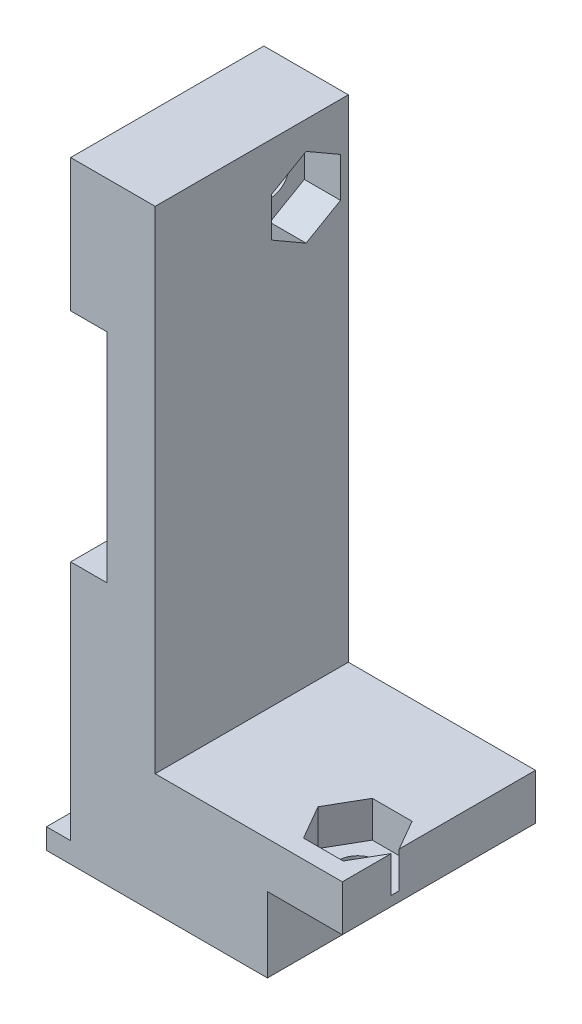
ISO-10303-21;
HEADER;
FILE_DESCRIPTION(('STEP AP214'),'2;1');
FILE_NAME('part.step','',(''),(''),'','','');
FILE_SCHEMA(('AUTOMOTIVE_DESIGN { 1 0 10303 214 1 1 1 1 }'));
ENDSEC;
DATA;
#1=APPLICATION_CONTEXT('core data for automotive mechanical design processes');
#2=APPLICATION_PROTOCOL_DEFINITION('international standard','automotive_design',2000,#1);
#3=PRODUCT_CONTEXT('',#1,'mechanical');
#4=PRODUCT('Part','Part','',(#3));
#5=PRODUCT_RELATED_PRODUCT_CATEGORY('part','',(#4));
#6=PRODUCT_DEFINITION_FORMATION('','',#4);
#7=PRODUCT_DEFINITION_CONTEXT('part definition',#1,'design');
#8=PRODUCT_DEFINITION('design','',#6,#7);
#9=PRODUCT_DEFINITION_SHAPE('','',#8);
#10=(LENGTH_UNIT() NAMED_UNIT(*) SI_UNIT(.MILLI.,.METRE.));
#11=(NAMED_UNIT(*) PLANE_ANGLE_UNIT() SI_UNIT($,.RADIAN.));
#12=(NAMED_UNIT(*) SI_UNIT($,.STERADIAN.) SOLID_ANGLE_UNIT());
#13=UNCERTAINTY_MEASURE_WITH_UNIT(LENGTH_MEASURE(1.E-05),#10,'distance_accuracy_value','');
#14=(GEOMETRIC_REPRESENTATION_CONTEXT(3) GLOBAL_UNCERTAINTY_ASSIGNED_CONTEXT((#13)) GLOBAL_UNIT_ASSIGNED_CONTEXT((#10,
#11,#12)) REPRESENTATION_CONTEXT('',''));
#15=CARTESIAN_POINT('',(0.,0.,0.));
#16=DIRECTION('',(0.,0.,1.));
#17=DIRECTION('',(1.,0.,0.));
#18=AXIS2_PLACEMENT_3D('',#15,#16,#17);
#19=CARTESIAN_POINT('',(21.4,50.701,11.62));
#20=DIRECTION('',(0.,-1.,0.));
#21=DIRECTION('',(1.,0.,0.));
#22=AXIS2_PLACEMENT_3D('',#19,#20,#21);
#23=CYLINDRICAL_SURFACE('',#22,1.6);
#24=CARTESIAN_POINT('',(21.4,6.2,11.62));
#25=DIRECTION('',(0.,-1.,0.));
#26=DIRECTION('',(1.,0.,0.));
#27=AXIS2_PLACEMENT_3D('',#24,#25,#26);
#28=CIRCLE('',#27,1.6);
#29=CARTESIAN_POINT('',(23.,6.2,11.62));
#30=VERTEX_POINT('',#29);
#31=EDGE_CURVE('E271',#30,#30,#28,.T.);
#32=ORIENTED_EDGE('',*,*,#31,.T.);
#33=EDGE_LOOP('',(#32));
#34=FACE_BOUND('',#33,.T.);
#35=CARTESIAN_POINT('',(21.4,7.,11.62));
#36=DIRECTION('',(0.,1.,0.));
#37=DIRECTION('',(0.,0.,1.));
#38=AXIS2_PLACEMENT_3D('',#35,#36,#37);
#39=CIRCLE('',#38,1.6);
#40=CARTESIAN_POINT('',(21.4,7.,13.22));
#41=VERTEX_POINT('',#40);
#42=EDGE_CURVE('E36',#41,#41,#39,.F.);
#43=ORIENTED_EDGE('',*,*,#42,.F.);
#44=EDGE_LOOP('',(#43));
#45=FACE_BOUND('',#44,.T.);
#46=ADVANCED_FACE('F32',(#34,#45),#23,.F.);
#47=CARTESIAN_POINT('',(24.501,45.1,3.5));
#48=DIRECTION('',(-1.,0.,0.));
#49=DIRECTION('',(0.,0.,1.));
#50=AXIS2_PLACEMENT_3D('',#47,#48,#49);
#51=CYLINDRICAL_SURFACE('',#50,1.6);
#52=CARTESIAN_POINT('',(2.,45.1,3.5));
#53=DIRECTION('',(-1.,0.,0.));
#54=DIRECTION('',(0.,0.,1.));
#55=AXIS2_PLACEMENT_3D('',#52,#53,#54);
#56=CIRCLE('',#55,1.6);
#57=CARTESIAN_POINT('',(2.,45.1,5.1));
#58=VERTEX_POINT('',#57);
#59=EDGE_CURVE('E321',#58,#58,#56,.T.);
#60=ORIENTED_EDGE('',*,*,#59,.T.);
#61=EDGE_LOOP('',(#60));
#62=FACE_BOUND('',#61,.T.);
#63=CARTESIAN_POINT('',(6.,45.1,3.5));
#64=DIRECTION('',(1.,0.,0.));
#65=DIRECTION('',(0.,0.,-1.));
#66=AXIS2_PLACEMENT_3D('',#63,#64,#65);
#67=CIRCLE('',#66,1.6);
#68=CARTESIAN_POINT('',(6.,45.1,1.9));
#69=VERTEX_POINT('',#68);
#70=EDGE_CURVE('E311',#69,#69,#67,.F.);
#71=ORIENTED_EDGE('',*,*,#70,.F.);
#72=EDGE_LOOP('',(#71));
#73=FACE_BOUND('',#72,.T.);
#74=ADVANCED_FACE('F427',(#62,#73),#51,.F.);
#75=CARTESIAN_POINT('',(24.5,0.,16.));
#76=DIRECTION('',(0.,1.,0.));
#77=DIRECTION('',(0.,0.,1.));
#78=AXIS2_PLACEMENT_3D('',#75,#76,#77);
#79=PLANE('',#78);
#80=DIRECTION('',(1.,0.,0.));
#81=VECTOR('',#80,1.);
#82=CARTESIAN_POINT('',(24.5,0.,0.));
#83=LINE('',#82,#81);
#84=CARTESIAN_POINT('',(0.,0.,0.));
#85=VERTEX_POINT('',#84);
#86=CARTESIAN_POINT('',(18.3,0.,0.));
#87=VERTEX_POINT('',#86);
#88=EDGE_CURVE('E342',#85,#87,#83,.T.);
#89=ORIENTED_EDGE('',*,*,#88,.T.);
#90=DIRECTION('',(0.,0.,1.));
#91=VECTOR('',#90,1.);
#92=CARTESIAN_POINT('',(18.3,0.,-0.001000000000001));
#93=LINE('',#92,#91);
#94=CARTESIAN_POINT('',(18.3,0.,16.));
#95=VERTEX_POINT('',#94);
#96=EDGE_CURVE('E333',#87,#95,#93,.T.);
#97=ORIENTED_EDGE('',*,*,#96,.T.);
#98=DIRECTION('',(1.,0.,0.));
#99=VECTOR('',#98,1.);
#100=CARTESIAN_POINT('',(24.5,0.,16.));
#101=LINE('',#100,#99);
#102=CARTESIAN_POINT('',(0.,0.,16.));
#103=VERTEX_POINT('',#102);
#104=EDGE_CURVE('E343',#103,#95,#101,.T.);
#105=ORIENTED_EDGE('',*,*,#104,.F.);
#106=DIRECTION('',(0.,0.,-1.));
#107=VECTOR('',#106,1.);
#108=CARTESIAN_POINT('',(0.,0.,16.));
#109=LINE('',#108,#107);
#110=EDGE_CURVE('E369',#103,#85,#109,.T.);
#111=ORIENTED_EDGE('',*,*,#110,.T.);
#112=EDGE_LOOP('',(#89,#97,#105,#111));
#113=FACE_BOUND('',#112,.T.);
#114=ADVANCED_FACE('F34',(#113),#79,.F.);
#115=CARTESIAN_POINT('',(24.5,10.,16.));
#116=DIRECTION('',(-1.,0.,0.));
#117=DIRECTION('',(0.,0.,1.));
#118=AXIS2_PLACEMENT_3D('',#115,#116,#117);
#119=PLANE('',#118);
#120=DIRECTION('',(0.,0.,-1.));
#121=VECTOR('',#120,1.);
#122=CARTESIAN_POINT('',(24.5,10.,16.));
#123=LINE('',#122,#121);
#124=CARTESIAN_POINT('',(24.5,10.,11.2893575034635));
#125=VERTEX_POINT('',#124);
#126=CARTESIAN_POINT('',(24.5,10.,0.));
#127=VERTEX_POINT('',#126);
#128=EDGE_CURVE('E41',#125,#127,#123,.T.);
#129=ORIENTED_EDGE('',*,*,#128,.F.);
#130=DIRECTION('',(0.,-1.,0.));
#131=VECTOR('',#130,1.);
#132=CARTESIAN_POINT('',(24.5,10.,11.2893575034635));
#133=LINE('',#132,#131);
#134=CARTESIAN_POINT('',(24.5,7.,11.2893575034635));
#135=VERTEX_POINT('',#134);
#136=EDGE_CURVE('E268',#125,#135,#133,.T.);
#137=ORIENTED_EDGE('',*,*,#136,.T.);
#138=DIRECTION('',(0.,0.,-1.));
#139=VECTOR('',#138,1.);
#140=CARTESIAN_POINT('',(24.5,7.,16.));
#141=LINE('',#140,#139);
#142=CARTESIAN_POINT('',(24.5,7.,11.9506424965365));
#143=VERTEX_POINT('',#142);
#144=EDGE_CURVE('E263',#143,#135,#141,.T.);
#145=ORIENTED_EDGE('',*,*,#144,.F.);
#146=DIRECTION('',(0.,1.,0.));
#147=VECTOR('',#146,1.);
#148=CARTESIAN_POINT('',(24.5,10.,11.9506424965365));
#149=LINE('',#148,#147);
#150=CARTESIAN_POINT('',(24.5,10.,11.9506424965365));
#151=VERTEX_POINT('',#150);
#152=EDGE_CURVE('E265',#143,#151,#149,.T.);
#153=ORIENTED_EDGE('',*,*,#152,.T.);
#154=CARTESIAN_POINT('',(24.5,10.,16.));
#155=VERTEX_POINT('',#154);
#156=EDGE_CURVE('E11',#155,#151,#123,.T.);
#157=ORIENTED_EDGE('',*,*,#156,.F.);
#158=DIRECTION('',(0.,1.,0.));
#159=VECTOR('',#158,1.);
#160=CARTESIAN_POINT('',(24.5,10.,16.));
#161=LINE('',#160,#159);
#162=CARTESIAN_POINT('',(24.5,6.2,16.));
#163=VERTEX_POINT('',#162);
#164=EDGE_CURVE('E346',#163,#155,#161,.T.);
#165=ORIENTED_EDGE('',*,*,#164,.F.);
#166=DIRECTION('',(0.,0.,1.));
#167=VECTOR('',#166,1.);
#168=CARTESIAN_POINT('',(24.5,6.2,-0.001000000000001));
#169=LINE('',#168,#167);
#170=CARTESIAN_POINT('',(24.5,6.2,0.));
#171=VERTEX_POINT('',#170);
#172=EDGE_CURVE('E332',#171,#163,#169,.T.);
#173=ORIENTED_EDGE('',*,*,#172,.F.);
#174=DIRECTION('',(0.,1.,0.));
#175=VECTOR('',#174,1.);
#176=CARTESIAN_POINT('',(24.5,10.,0.));
#177=LINE('',#176,#175);
#178=EDGE_CURVE('E372',#171,#127,#177,.T.);
#179=ORIENTED_EDGE('',*,*,#178,.T.);
#180=EDGE_LOOP('',(#129,#137,#145,#153,#157,#165,#173,#179));
#181=FACE_BOUND('',#180,.T.);
#182=ADVANCED_FACE('F435',(#181),#119,.F.);
#183=CARTESIAN_POINT('',(9.00000000000001,10.,16.));
#184=DIRECTION('',(0.,-1.,0.));
#185=DIRECTION('',(0.,0.,-1.));
#186=AXIS2_PLACEMENT_3D('',#183,#184,#185);
#187=PLANE('',#186);
#188=DIRECTION('',(-1.,0.,0.));
#189=VECTOR('',#188,1.);
#190=CARTESIAN_POINT('',(23.0454482671904,10.,8.77));
#191=LINE('',#190,#189);
#192=CARTESIAN_POINT('',(23.0454482671904,10.,8.77));
#193=VERTEX_POINT('',#192);
#194=CARTESIAN_POINT('',(19.7545517328096,10.,8.77));
#195=VERTEX_POINT('',#194);
#196=EDGE_CURVE('E237',#193,#195,#191,.T.);
#197=ORIENTED_EDGE('',*,*,#196,.F.);
#198=DIRECTION('',(-0.499999999999999,0.,-0.866025403784439));
#199=VECTOR('',#198,1.);
#200=CARTESIAN_POINT('',(24.6908965343809,10.,11.62));
#201=LINE('',#200,#199);
#202=EDGE_CURVE('E251',#125,#193,#201,.T.);
#203=ORIENTED_EDGE('',*,*,#202,.F.);
#204=ORIENTED_EDGE('',*,*,#128,.T.);
#205=DIRECTION('',(-1.,0.,0.));
#206=VECTOR('',#205,1.);
#207=CARTESIAN_POINT('',(9.00000000000001,10.,0.));
#208=LINE('',#207,#206);
#209=CARTESIAN_POINT('',(9.00000000000001,10.,0.));
#210=VERTEX_POINT('',#209);
#211=EDGE_CURVE('E375',#127,#210,#208,.T.);
#212=ORIENTED_EDGE('',*,*,#211,.T.);
#213=DIRECTION('',(0.,0.,-1.));
#214=VECTOR('',#213,1.);
#215=CARTESIAN_POINT('',(9.00000000000001,10.,16.));
#216=LINE('',#215,#214);
#217=CARTESIAN_POINT('',(9.00000000000001,10.,16.));
#218=VERTEX_POINT('',#217);
#219=EDGE_CURVE('E420',#218,#210,#216,.T.);
#220=ORIENTED_EDGE('',*,*,#219,.F.);
#221=DIRECTION('',(-1.,0.,0.));
#222=VECTOR('',#221,1.);
#223=CARTESIAN_POINT('',(9.00000000000001,10.,16.));
#224=LINE('',#223,#222);
#225=EDGE_CURVE('E349',#155,#218,#224,.T.);
#226=ORIENTED_EDGE('',*,*,#225,.F.);
#227=ORIENTED_EDGE('',*,*,#156,.T.);
#228=DIRECTION('',(0.5,0.,-0.866025403784439));
#229=VECTOR('',#228,1.);
#230=CARTESIAN_POINT('',(23.0454482671904,10.,14.47));
#231=LINE('',#230,#229);
#232=CARTESIAN_POINT('',(23.0454482671904,10.,14.47));
#233=VERTEX_POINT('',#232);
#234=EDGE_CURVE('E249',#233,#151,#231,.T.);
#235=ORIENTED_EDGE('',*,*,#234,.F.);
#236=DIRECTION('',(1.,0.,0.));
#237=VECTOR('',#236,1.);
#238=CARTESIAN_POINT('',(19.7545517328096,10.,14.47));
#239=LINE('',#238,#237);
#240=CARTESIAN_POINT('',(19.7545517328096,10.,14.47));
#241=VERTEX_POINT('',#240);
#242=EDGE_CURVE('E247',#241,#233,#239,.T.);
#243=ORIENTED_EDGE('',*,*,#242,.F.);
#244=DIRECTION('',(0.499999999999999,0.,0.866025403784439));
#245=VECTOR('',#244,1.);
#246=CARTESIAN_POINT('',(18.1091034656191,10.,11.62));
#247=LINE('',#246,#245);
#248=CARTESIAN_POINT('',(18.1091034656191,10.,11.62));
#249=VERTEX_POINT('',#248);
#250=EDGE_CURVE('E49',#249,#241,#247,.T.);
#251=ORIENTED_EDGE('',*,*,#250,.F.);
#252=DIRECTION('',(-0.500000000000001,0.,0.866025403784438));
#253=VECTOR('',#252,1.);
#254=CARTESIAN_POINT('',(19.7545517328096,10.,8.77));
#255=LINE('',#254,#253);
#256=EDGE_CURVE('E234',#195,#249,#255,.T.);
#257=ORIENTED_EDGE('',*,*,#256,.F.);
#258=EDGE_LOOP('',(#197,#203,#204,#212,#220,#226,#227,#235,#243,#251,#257));
#259=FACE_BOUND('',#258,.T.);
#260=ADVANCED_FACE('F494',(#259),#187,.F.);
#261=CARTESIAN_POINT('',(9.,50.7,16.));
#262=DIRECTION('',(-1.,0.,0.));
#263=DIRECTION('',(0.,-1.,0.));
#264=AXIS2_PLACEMENT_3D('',#261,#262,#263);
#265=PLANE('',#264);
#266=DIRECTION('',(0.,0.499999999999999,0.866025403784439));
#267=VECTOR('',#266,1.);
#268=CARTESIAN_POINT('',(9.,46.7454482671904,0.650000000000012));
#269=LINE('',#268,#267);
#270=CARTESIAN_POINT('',(9.,46.7454482671904,0.650000000000012));
#271=VERTEX_POINT('',#270);
#272=CARTESIAN_POINT('',(9.,48.3908965343809,3.5));
#273=VERTEX_POINT('',#272);
#274=EDGE_CURVE('E295',#271,#273,#269,.T.);
#275=ORIENTED_EDGE('',*,*,#274,.F.);
#276=DIRECTION('',(0.,1.,0.));
#277=VECTOR('',#276,1.);
#278=CARTESIAN_POINT('',(9.,43.4545517328096,0.650000000000012));
#279=LINE('',#278,#277);
#280=CARTESIAN_POINT('',(9.,43.4545517328096,0.650000000000012));
#281=VERTEX_POINT('',#280);
#282=EDGE_CURVE('E57',#281,#271,#279,.T.);
#283=ORIENTED_EDGE('',*,*,#282,.F.);
#284=DIRECTION('',(0.,0.499999999999999,-0.866025403784439));
#285=VECTOR('',#284,1.);
#286=CARTESIAN_POINT('',(9.,41.8091034656191,3.5));
#287=LINE('',#286,#285);
#288=CARTESIAN_POINT('',(9.,41.8091034656191,3.5));
#289=VERTEX_POINT('',#288);
#290=EDGE_CURVE('E278',#289,#281,#287,.T.);
#291=ORIENTED_EDGE('',*,*,#290,.F.);
#292=DIRECTION('',(0.,-0.5,-0.866025403784439));
#293=VECTOR('',#292,1.);
#294=CARTESIAN_POINT('',(9.,43.4545517328096,6.35));
#295=LINE('',#294,#293);
#296=CARTESIAN_POINT('',(9.,43.4545517328096,6.35));
#297=VERTEX_POINT('',#296);
#298=EDGE_CURVE('E304',#297,#289,#295,.T.);
#299=ORIENTED_EDGE('',*,*,#298,.F.);
#300=DIRECTION('',(0.,-1.,0.));
#301=VECTOR('',#300,1.);
#302=CARTESIAN_POINT('',(9.,46.7454482671904,6.35));
#303=LINE('',#302,#301);
#304=CARTESIAN_POINT('',(9.,46.7454482671904,6.35));
#305=VERTEX_POINT('',#304);
#306=EDGE_CURVE('E301',#305,#297,#303,.T.);
#307=ORIENTED_EDGE('',*,*,#306,.F.);
#308=DIRECTION('',(0.,-0.499999999999999,0.866025403784439));
#309=VECTOR('',#308,1.);
#310=CARTESIAN_POINT('',(9.,48.3908965343809,3.5));
#311=LINE('',#310,#309);
#312=EDGE_CURVE('E298',#273,#305,#311,.T.);
#313=ORIENTED_EDGE('',*,*,#312,.F.);
#314=EDGE_LOOP('',(#275,#283,#291,#299,#307,#313));
#315=FACE_BOUND('',#314,.T.);
#316=DIRECTION('',(0.,1.,0.));
#317=VECTOR('',#316,1.);
#318=CARTESIAN_POINT('',(9.,50.7,0.));
#319=LINE('',#318,#317);
#320=CARTESIAN_POINT('',(9.,50.7,0.));
#321=VERTEX_POINT('',#320);
#322=EDGE_CURVE('E377',#210,#321,#319,.T.);
#323=ORIENTED_EDGE('',*,*,#322,.T.);
#324=DIRECTION('',(0.,0.,-1.));
#325=VECTOR('',#324,1.);
#326=CARTESIAN_POINT('',(9.,50.7,16.));
#327=LINE('',#326,#325);
#328=CARTESIAN_POINT('',(9.,50.7,16.));
#329=VERTEX_POINT('',#328);
#330=EDGE_CURVE('E417',#329,#321,#327,.T.);
#331=ORIENTED_EDGE('',*,*,#330,.F.);
#332=DIRECTION('',(0.,1.,0.));
#333=VECTOR('',#332,1.);
#334=CARTESIAN_POINT('',(9.,50.7,16.));
#335=LINE('',#334,#333);
#336=EDGE_CURVE('E351',#218,#329,#335,.T.);
#337=ORIENTED_EDGE('',*,*,#336,.F.);
#338=ORIENTED_EDGE('',*,*,#219,.T.);
#339=EDGE_LOOP('',(#323,#331,#337,#338));
#340=FACE_BOUND('',#339,.T.);
#341=ADVANCED_FACE('F490',(#315,#340),#265,.F.);
#342=CARTESIAN_POINT('',(2.,50.7,16.));
#343=DIRECTION('',(0.,-1.,0.));
#344=DIRECTION('',(1.,0.,0.));
#345=AXIS2_PLACEMENT_3D('',#342,#343,#344);
#346=PLANE('',#345);
#347=DIRECTION('',(-1.,0.,0.));
#348=VECTOR('',#347,1.);
#349=CARTESIAN_POINT('',(2.,50.7,0.));
#350=LINE('',#349,#348);
#351=CARTESIAN_POINT('',(2.,50.7,0.));
#352=VERTEX_POINT('',#351);
#353=EDGE_CURVE('E379',#321,#352,#350,.T.);
#354=ORIENTED_EDGE('',*,*,#353,.T.);
#355=DIRECTION('',(0.,0.,-1.));
#356=VECTOR('',#355,1.);
#357=CARTESIAN_POINT('',(2.,50.7,16.));
#358=LINE('',#357,#356);
#359=CARTESIAN_POINT('',(2.,50.7,16.));
#360=VERTEX_POINT('',#359);
#361=EDGE_CURVE('E414',#360,#352,#358,.T.);
#362=ORIENTED_EDGE('',*,*,#361,.F.);
#363=DIRECTION('',(-1.,0.,0.));
#364=VECTOR('',#363,1.);
#365=CARTESIAN_POINT('',(2.,50.7,16.));
#366=LINE('',#365,#364);
#367=EDGE_CURVE('E353',#329,#360,#366,.T.);
#368=ORIENTED_EDGE('',*,*,#367,.F.);
#369=ORIENTED_EDGE('',*,*,#330,.T.);
#370=EDGE_LOOP('',(#354,#362,#368,#369));
#371=FACE_BOUND('',#370,.T.);
#372=ADVANCED_FACE('F486',(#371),#346,.F.);
#373=CARTESIAN_POINT('',(2.,39.7,16.));
#374=DIRECTION('',(1.,0.,0.));
#375=DIRECTION('',(0.,0.,-1.));
#376=AXIS2_PLACEMENT_3D('',#373,#374,#375);
#377=PLANE('',#376);
#378=ORIENTED_EDGE('',*,*,#59,.F.);
#379=EDGE_LOOP('',(#378));
#380=FACE_BOUND('',#379,.T.);
#381=DIRECTION('',(0.,-1.,0.));
#382=VECTOR('',#381,1.);
#383=CARTESIAN_POINT('',(2.,39.7,0.));
#384=LINE('',#383,#382);
#385=CARTESIAN_POINT('',(2.,39.7,0.));
#386=VERTEX_POINT('',#385);
#387=EDGE_CURVE('E381',#352,#386,#384,.T.);
#388=ORIENTED_EDGE('',*,*,#387,.T.);
#389=DIRECTION('',(0.,0.,-1.));
#390=VECTOR('',#389,1.);
#391=CARTESIAN_POINT('',(2.,39.7,16.));
#392=LINE('',#391,#390);
#393=CARTESIAN_POINT('',(2.,39.7,16.));
#394=VERTEX_POINT('',#393);
#395=EDGE_CURVE('E411',#394,#386,#392,.T.);
#396=ORIENTED_EDGE('',*,*,#395,.F.);
#397=DIRECTION('',(0.,-1.,0.));
#398=VECTOR('',#397,1.);
#399=CARTESIAN_POINT('',(2.,39.7,16.));
#400=LINE('',#399,#398);
#401=EDGE_CURVE('E355',#360,#394,#400,.T.);
#402=ORIENTED_EDGE('',*,*,#401,.F.);
#403=ORIENTED_EDGE('',*,*,#361,.T.);
#404=EDGE_LOOP('',(#388,#396,#402,#403));
#405=FACE_BOUND('',#404,.T.);
#406=ADVANCED_FACE('F482',(#380,#405),#377,.F.);
#407=CARTESIAN_POINT('',(5.,39.7,16.));
#408=DIRECTION('',(0.,1.,0.));
#409=DIRECTION('',(0.,0.,1.));
#410=AXIS2_PLACEMENT_3D('',#407,#408,#409);
#411=PLANE('',#410);
#412=DIRECTION('',(1.,0.,0.));
#413=VECTOR('',#412,1.);
#414=CARTESIAN_POINT('',(5.,39.7,0.));
#415=LINE('',#414,#413);
#416=CARTESIAN_POINT('',(5.,39.7,0.));
#417=VERTEX_POINT('',#416);
#418=EDGE_CURVE('E383',#386,#417,#415,.T.);
#419=ORIENTED_EDGE('',*,*,#418,.T.);
#420=DIRECTION('',(0.,0.,-1.));
#421=VECTOR('',#420,1.);
#422=CARTESIAN_POINT('',(5.,39.7,16.));
#423=LINE('',#422,#421);
#424=CARTESIAN_POINT('',(5.,39.7,16.));
#425=VERTEX_POINT('',#424);
#426=EDGE_CURVE('E408',#425,#417,#423,.T.);
#427=ORIENTED_EDGE('',*,*,#426,.F.);
#428=DIRECTION('',(1.,0.,0.));
#429=VECTOR('',#428,1.);
#430=CARTESIAN_POINT('',(5.,39.7,16.));
#431=LINE('',#430,#429);
#432=EDGE_CURVE('E357',#394,#425,#431,.T.);
#433=ORIENTED_EDGE('',*,*,#432,.F.);
#434=ORIENTED_EDGE('',*,*,#395,.T.);
#435=EDGE_LOOP('',(#419,#427,#433,#434));
#436=FACE_BOUND('',#435,.T.);
#437=ADVANCED_FACE('F478',(#436),#411,.F.);
#438=CARTESIAN_POINT('',(5.,21.7,16.));
#439=DIRECTION('',(1.,0.,0.));
#440=DIRECTION('',(0.,0.,-1.));
#441=AXIS2_PLACEMENT_3D('',#438,#439,#440);
#442=PLANE('',#441);
#443=DIRECTION('',(0.,-1.,0.));
#444=VECTOR('',#443,1.);
#445=CARTESIAN_POINT('',(5.,21.7,0.));
#446=LINE('',#445,#444);
#447=CARTESIAN_POINT('',(5.,21.7,0.));
#448=VERTEX_POINT('',#447);
#449=EDGE_CURVE('E385',#417,#448,#446,.T.);
#450=ORIENTED_EDGE('',*,*,#449,.T.);
#451=DIRECTION('',(0.,0.,-1.));
#452=VECTOR('',#451,1.);
#453=CARTESIAN_POINT('',(5.,21.7,16.));
#454=LINE('',#453,#452);
#455=CARTESIAN_POINT('',(5.,21.7,16.));
#456=VERTEX_POINT('',#455);
#457=EDGE_CURVE('E405',#456,#448,#454,.T.);
#458=ORIENTED_EDGE('',*,*,#457,.F.);
#459=DIRECTION('',(0.,-1.,0.));
#460=VECTOR('',#459,1.);
#461=CARTESIAN_POINT('',(5.,21.7,16.));
#462=LINE('',#461,#460);
#463=EDGE_CURVE('E359',#425,#456,#462,.T.);
#464=ORIENTED_EDGE('',*,*,#463,.F.);
#465=ORIENTED_EDGE('',*,*,#426,.T.);
#466=EDGE_LOOP('',(#450,#458,#464,#465));
#467=FACE_BOUND('',#466,.T.);
#468=ADVANCED_FACE('F474',(#467),#442,.F.);
#469=CARTESIAN_POINT('',(2.,21.7,16.));
#470=DIRECTION('',(0.,-1.,0.));
#471=DIRECTION('',(0.,0.,-1.));
#472=AXIS2_PLACEMENT_3D('',#469,#470,#471);
#473=PLANE('',#472);
#474=DIRECTION('',(-1.,0.,0.));
#475=VECTOR('',#474,1.);
#476=CARTESIAN_POINT('',(2.,21.7,0.));
#477=LINE('',#476,#475);
#478=CARTESIAN_POINT('',(2.,21.7,0.));
#479=VERTEX_POINT('',#478);
#480=EDGE_CURVE('E387',#448,#479,#477,.T.);
#481=ORIENTED_EDGE('',*,*,#480,.T.);
#482=DIRECTION('',(0.,0.,-1.));
#483=VECTOR('',#482,1.);
#484=CARTESIAN_POINT('',(2.,21.7,16.));
#485=LINE('',#484,#483);
#486=CARTESIAN_POINT('',(2.,21.7,16.));
#487=VERTEX_POINT('',#486);
#488=EDGE_CURVE('E402',#487,#479,#485,.T.);
#489=ORIENTED_EDGE('',*,*,#488,.F.);
#490=DIRECTION('',(-1.,0.,0.));
#491=VECTOR('',#490,1.);
#492=CARTESIAN_POINT('',(2.,21.7,16.));
#493=LINE('',#492,#491);
#494=EDGE_CURVE('E361',#456,#487,#493,.T.);
#495=ORIENTED_EDGE('',*,*,#494,.F.);
#496=ORIENTED_EDGE('',*,*,#457,.T.);
#497=EDGE_LOOP('',(#481,#489,#495,#496));
#498=FACE_BOUND('',#497,.T.);
#499=ADVANCED_FACE('F470',(#498),#473,.F.);
#500=CARTESIAN_POINT('',(2.,1.7,16.));
#501=DIRECTION('',(1.,0.,0.));
#502=DIRECTION('',(0.,0.,-1.));
#503=AXIS2_PLACEMENT_3D('',#500,#501,#502);
#504=PLANE('',#503);
#505=DIRECTION('',(0.,-1.,0.));
#506=VECTOR('',#505,1.);
#507=CARTESIAN_POINT('',(2.,1.7,0.));
#508=LINE('',#507,#506);
#509=CARTESIAN_POINT('',(2.,1.7,0.));
#510=VERTEX_POINT('',#509);
#511=EDGE_CURVE('E389',#479,#510,#508,.T.);
#512=ORIENTED_EDGE('',*,*,#511,.T.);
#513=DIRECTION('',(0.,0.,-1.));
#514=VECTOR('',#513,1.);
#515=CARTESIAN_POINT('',(2.,1.7,16.));
#516=LINE('',#515,#514);
#517=CARTESIAN_POINT('',(2.,1.7,16.));
#518=VERTEX_POINT('',#517);
#519=EDGE_CURVE('E399',#518,#510,#516,.T.);
#520=ORIENTED_EDGE('',*,*,#519,.F.);
#521=DIRECTION('',(0.,-1.,0.));
#522=VECTOR('',#521,1.);
#523=CARTESIAN_POINT('',(2.,1.7,16.));
#524=LINE('',#523,#522);
#525=EDGE_CURVE('E363',#487,#518,#524,.T.);
#526=ORIENTED_EDGE('',*,*,#525,.F.);
#527=ORIENTED_EDGE('',*,*,#488,.T.);
#528=EDGE_LOOP('',(#512,#520,#526,#527));
#529=FACE_BOUND('',#528,.T.);
#530=ADVANCED_FACE('F466',(#529),#504,.F.);
#531=CARTESIAN_POINT('',(0.,1.7,16.));
#532=DIRECTION('',(0.,-1.,0.));
#533=DIRECTION('',(0.,0.,-1.));
#534=AXIS2_PLACEMENT_3D('',#531,#532,#533);
#535=PLANE('',#534);
#536=DIRECTION('',(-1.,0.,0.));
#537=VECTOR('',#536,1.);
#538=CARTESIAN_POINT('',(0.,1.7,0.));
#539=LINE('',#538,#537);
#540=CARTESIAN_POINT('',(0.,1.7,0.));
#541=VERTEX_POINT('',#540);
#542=EDGE_CURVE('E391',#510,#541,#539,.T.);
#543=ORIENTED_EDGE('',*,*,#542,.T.);
#544=DIRECTION('',(0.,0.,-1.));
#545=VECTOR('',#544,1.);
#546=CARTESIAN_POINT('',(0.,1.7,16.));
#547=LINE('',#546,#545);
#548=CARTESIAN_POINT('',(0.,1.7,16.));
#549=VERTEX_POINT('',#548);
#550=EDGE_CURVE('E396',#549,#541,#547,.T.);
#551=ORIENTED_EDGE('',*,*,#550,.F.);
#552=DIRECTION('',(-1.,0.,0.));
#553=VECTOR('',#552,1.);
#554=CARTESIAN_POINT('',(0.,1.7,16.));
#555=LINE('',#554,#553);
#556=EDGE_CURVE('E365',#518,#549,#555,.T.);
#557=ORIENTED_EDGE('',*,*,#556,.F.);
#558=ORIENTED_EDGE('',*,*,#519,.T.);
#559=EDGE_LOOP('',(#543,#551,#557,#558));
#560=FACE_BOUND('',#559,.T.);
#561=ADVANCED_FACE('F462',(#560),#535,.F.);
#562=CARTESIAN_POINT('',(0.,0.,16.));
#563=DIRECTION('',(1.,0.,0.));
#564=DIRECTION('',(0.,0.,-1.));
#565=AXIS2_PLACEMENT_3D('',#562,#563,#564);
#566=PLANE('',#565);
#567=DIRECTION('',(0.,-1.,0.));
#568=VECTOR('',#567,1.);
#569=CARTESIAN_POINT('',(0.,0.,0.));
#570=LINE('',#569,#568);
#571=EDGE_CURVE('E347',#541,#85,#570,.T.);
#572=ORIENTED_EDGE('',*,*,#571,.T.);
#573=ORIENTED_EDGE('',*,*,#110,.F.);
#574=DIRECTION('',(0.,-1.,0.));
#575=VECTOR('',#574,1.);
#576=CARTESIAN_POINT('',(0.,0.,16.));
#577=LINE('',#576,#575);
#578=EDGE_CURVE('E367',#549,#103,#577,.T.);
#579=ORIENTED_EDGE('',*,*,#578,.F.);
#580=ORIENTED_EDGE('',*,*,#550,.T.);
#581=EDGE_LOOP('',(#572,#573,#579,#580));
#582=FACE_BOUND('',#581,.T.);
#583=ADVANCED_FACE('F455',(#582),#566,.F.);
#584=CARTESIAN_POINT('',(0.,0.,16.));
#585=DIRECTION('',(0.,0.,-1.));
#586=DIRECTION('',(-1.,0.,0.));
#587=AXIS2_PLACEMENT_3D('',#584,#585,#586);
#588=PLANE('',#587);
#589=ORIENTED_EDGE('',*,*,#104,.T.);
#590=DIRECTION('',(0.,-1.,0.));
#591=VECTOR('',#590,1.);
#592=CARTESIAN_POINT('',(18.3,0.,16.));
#593=LINE('',#592,#591);
#594=CARTESIAN_POINT('',(18.3,6.2,16.));
#595=VERTEX_POINT('',#594);
#596=EDGE_CURVE('E330',#595,#95,#593,.T.);
#597=ORIENTED_EDGE('',*,*,#596,.F.);
#598=DIRECTION('',(-1.,0.,0.));
#599=VECTOR('',#598,1.);
#600=CARTESIAN_POINT('',(24.5,6.2,16.));
#601=LINE('',#600,#599);
#602=EDGE_CURVE('E327',#163,#595,#601,.T.);
#603=ORIENTED_EDGE('',*,*,#602,.F.);
#604=ORIENTED_EDGE('',*,*,#164,.T.);
#605=ORIENTED_EDGE('',*,*,#225,.T.);
#606=ORIENTED_EDGE('',*,*,#336,.T.);
#607=ORIENTED_EDGE('',*,*,#367,.T.);
#608=ORIENTED_EDGE('',*,*,#401,.T.);
#609=ORIENTED_EDGE('',*,*,#432,.T.);
#610=ORIENTED_EDGE('',*,*,#463,.T.);
#611=ORIENTED_EDGE('',*,*,#494,.T.);
#612=ORIENTED_EDGE('',*,*,#525,.T.);
#613=ORIENTED_EDGE('',*,*,#556,.T.);
#614=ORIENTED_EDGE('',*,*,#578,.T.);
#615=EDGE_LOOP('',(#589,#597,#603,#604,#605,#606,#607,#608,#609,#610,#611,#612,#613,#614));
#616=FACE_BOUND('',#615,.T.);
#617=ADVANCED_FACE('F452',(#616),#588,.F.);
#618=CARTESIAN_POINT('',(0.,0.,0.));
#619=DIRECTION('',(0.,0.,-1.));
#620=DIRECTION('',(-1.,0.,0.));
#621=AXIS2_PLACEMENT_3D('',#618,#619,#620);
#622=PLANE('',#621);
#623=DIRECTION('',(0.,-1.,0.));
#624=VECTOR('',#623,1.);
#625=CARTESIAN_POINT('',(18.3,0.,0.));
#626=LINE('',#625,#624);
#627=CARTESIAN_POINT('',(18.3,6.2,0.));
#628=VERTEX_POINT('',#627);
#629=EDGE_CURVE('E324',#628,#87,#626,.T.);
#630=ORIENTED_EDGE('',*,*,#629,.T.);
#631=ORIENTED_EDGE('',*,*,#88,.F.);
#632=ORIENTED_EDGE('',*,*,#571,.F.);
#633=ORIENTED_EDGE('',*,*,#542,.F.);
#634=ORIENTED_EDGE('',*,*,#511,.F.);
#635=ORIENTED_EDGE('',*,*,#480,.F.);
#636=ORIENTED_EDGE('',*,*,#449,.F.);
#637=ORIENTED_EDGE('',*,*,#418,.F.);
#638=ORIENTED_EDGE('',*,*,#387,.F.);
#639=ORIENTED_EDGE('',*,*,#353,.F.);
#640=ORIENTED_EDGE('',*,*,#322,.F.);
#641=ORIENTED_EDGE('',*,*,#211,.F.);
#642=ORIENTED_EDGE('',*,*,#178,.F.);
#643=DIRECTION('',(-1.,0.,0.));
#644=VECTOR('',#643,1.);
#645=CARTESIAN_POINT('',(24.5,6.2,0.));
#646=LINE('',#645,#644);
#647=EDGE_CURVE('E336',#171,#628,#646,.T.);
#648=ORIENTED_EDGE('',*,*,#647,.T.);
#649=EDGE_LOOP('',(#630,#631,#632,#633,#634,#635,#636,#637,#638,#639,#640,#641,#642,#648));
#650=FACE_BOUND('',#649,.T.);
#651=ADVANCED_FACE('F447',(#650),#622,.T.);
#652=CARTESIAN_POINT('',(18.3,0.,-0.001000000000001));
#653=DIRECTION('',(-1.,0.,0.));
#654=DIRECTION('',(0.,0.,1.));
#655=AXIS2_PLACEMENT_3D('',#652,#653,#654);
#656=PLANE('',#655);
#657=DIRECTION('',(0.,0.,1.));
#658=VECTOR('',#657,1.);
#659=CARTESIAN_POINT('',(18.3,6.2,-0.001000000000001));
#660=LINE('',#659,#658);
#661=EDGE_CURVE('E337',#628,#595,#660,.T.);
#662=ORIENTED_EDGE('',*,*,#661,.T.);
#663=ORIENTED_EDGE('',*,*,#596,.T.);
#664=ORIENTED_EDGE('',*,*,#96,.F.);
#665=ORIENTED_EDGE('',*,*,#629,.F.);
#666=EDGE_LOOP('',(#662,#663,#664,#665));
#667=FACE_BOUND('',#666,.T.);
#668=ADVANCED_FACE('F443',(#667),#656,.F.);
#669=CARTESIAN_POINT('',(24.5,6.2,-0.001000000000001));
#670=DIRECTION('',(0.,1.,0.));
#671=DIRECTION('',(-1.,0.,0.));
#672=AXIS2_PLACEMENT_3D('',#669,#670,#671);
#673=PLANE('',#672);
#674=ORIENTED_EDGE('',*,*,#31,.F.);
#675=EDGE_LOOP('',(#674));
#676=FACE_BOUND('',#675,.T.);
#677=ORIENTED_EDGE('',*,*,#172,.T.);
#678=ORIENTED_EDGE('',*,*,#602,.T.);
#679=ORIENTED_EDGE('',*,*,#661,.F.);
#680=ORIENTED_EDGE('',*,*,#647,.F.);
#681=EDGE_LOOP('',(#677,#678,#679,#680));
#682=FACE_BOUND('',#681,.T.);
#683=ADVANCED_FACE('F446',(#676,#682),#673,.F.);
#684=CARTESIAN_POINT('',(6.,46.7454482671904,0.650000000000012));
#685=DIRECTION('',(1.,0.,0.));
#686=DIRECTION('',(0.,0.,-1.));
#687=AXIS2_PLACEMENT_3D('',#684,#685,#686);
#688=PLANE('',#687);
#689=DIRECTION('',(0.,1.,0.));
#690=VECTOR('',#689,1.);
#691=CARTESIAN_POINT('',(6.,43.4545517328096,0.650000000000012));
#692=LINE('',#691,#690);
#693=CARTESIAN_POINT('',(6.,43.4545517328096,0.650000000000012));
#694=VERTEX_POINT('',#693);
#695=CARTESIAN_POINT('',(6.,46.7454482671904,0.650000000000012));
#696=VERTEX_POINT('',#695);
#697=EDGE_CURVE('E274',#694,#696,#692,.T.);
#698=ORIENTED_EDGE('',*,*,#697,.T.);
#699=DIRECTION('',(0.,0.499999999999999,0.866025403784439));
#700=VECTOR('',#699,1.);
#701=CARTESIAN_POINT('',(6.,46.7454482671904,0.650000000000012));
#702=LINE('',#701,#700);
#703=CARTESIAN_POINT('',(6.,48.3908965343809,3.5));
#704=VERTEX_POINT('',#703);
#705=EDGE_CURVE('E277',#696,#704,#702,.T.);
#706=ORIENTED_EDGE('',*,*,#705,.T.);
#707=DIRECTION('',(0.,-0.499999999999999,0.866025403784439));
#708=VECTOR('',#707,1.);
#709=CARTESIAN_POINT('',(6.,48.3908965343809,3.5));
#710=LINE('',#709,#708);
#711=CARTESIAN_POINT('',(6.,46.7454482671904,6.35));
#712=VERTEX_POINT('',#711);
#713=EDGE_CURVE('E281',#704,#712,#710,.T.);
#714=ORIENTED_EDGE('',*,*,#713,.T.);
#715=DIRECTION('',(0.,-1.,0.));
#716=VECTOR('',#715,1.);
#717=CARTESIAN_POINT('',(6.,46.7454482671904,6.35));
#718=LINE('',#717,#716);
#719=CARTESIAN_POINT('',(6.,43.4545517328096,6.35));
#720=VERTEX_POINT('',#719);
#721=EDGE_CURVE('E284',#712,#720,#718,.T.);
#722=ORIENTED_EDGE('',*,*,#721,.T.);
#723=DIRECTION('',(0.,-0.5,-0.866025403784439));
#724=VECTOR('',#723,1.);
#725=CARTESIAN_POINT('',(6.,43.4545517328096,6.35));
#726=LINE('',#725,#724);
#727=CARTESIAN_POINT('',(6.,41.8091034656191,3.5));
#728=VERTEX_POINT('',#727);
#729=EDGE_CURVE('E287',#720,#728,#726,.T.);
#730=ORIENTED_EDGE('',*,*,#729,.T.);
#731=DIRECTION('',(0.,0.499999999999999,-0.866025403784439));
#732=VECTOR('',#731,1.);
#733=CARTESIAN_POINT('',(6.,41.8091034656191,3.5));
#734=LINE('',#733,#732);
#735=EDGE_CURVE('E290',#728,#694,#734,.T.);
#736=ORIENTED_EDGE('',*,*,#735,.T.);
#737=EDGE_LOOP('',(#698,#706,#714,#722,#730,#736));
#738=FACE_BOUND('',#737,.T.);
#739=ORIENTED_EDGE('',*,*,#70,.T.);
#740=EDGE_LOOP('',(#739));
#741=FACE_BOUND('',#740,.T.);
#742=ADVANCED_FACE('F425',(#738,#741),#688,.T.);
#743=CARTESIAN_POINT('',(6.,43.4545517328096,0.650000000000012));
#744=DIRECTION('',(0.,0.,-1.));
#745=DIRECTION('',(-1.,0.,0.));
#746=AXIS2_PLACEMENT_3D('',#743,#744,#745);
#747=PLANE('',#746);
#748=ORIENTED_EDGE('',*,*,#282,.T.);
#749=DIRECTION('',(1.,0.,0.));
#750=VECTOR('',#749,1.);
#751=CARTESIAN_POINT('',(6.,46.7454482671904,0.650000000000012));
#752=LINE('',#751,#750);
#753=EDGE_CURVE('E293',#696,#271,#752,.T.);
#754=ORIENTED_EDGE('',*,*,#753,.F.);
#755=ORIENTED_EDGE('',*,*,#697,.F.);
#756=DIRECTION('',(1.,0.,0.));
#757=VECTOR('',#756,1.);
#758=CARTESIAN_POINT('',(6.,43.4545517328096,0.650000000000012));
#759=LINE('',#758,#757);
#760=EDGE_CURVE('E309',#694,#281,#759,.T.);
#761=ORIENTED_EDGE('',*,*,#760,.T.);
#762=EDGE_LOOP('',(#748,#754,#755,#761));
#763=FACE_BOUND('',#762,.T.);
#764=ADVANCED_FACE('F441',(#763),#747,.F.);
#765=CARTESIAN_POINT('',(6.,41.8091034656191,3.5));
#766=DIRECTION('',(0.,-0.866025403784439,-0.499999999999999));
#767=DIRECTION('',(0.,0.499999999999999,-0.866025403784439));
#768=AXIS2_PLACEMENT_3D('',#765,#766,#767);
#769=PLANE('',#768);
#770=ORIENTED_EDGE('',*,*,#290,.T.);
#771=ORIENTED_EDGE('',*,*,#760,.F.);
#772=ORIENTED_EDGE('',*,*,#735,.F.);
#773=DIRECTION('',(1.,0.,0.));
#774=VECTOR('',#773,1.);
#775=CARTESIAN_POINT('',(6.,41.8091034656191,3.5));
#776=LINE('',#775,#774);
#777=EDGE_CURVE('E312',#728,#289,#776,.T.);
#778=ORIENTED_EDGE('',*,*,#777,.T.);
#779=EDGE_LOOP('',(#770,#771,#772,#778));
#780=FACE_BOUND('',#779,.T.);
#781=ADVANCED_FACE('F580',(#780),#769,.F.);
#782=CARTESIAN_POINT('',(6.,43.4545517328096,6.35));
#783=DIRECTION('',(0.,-0.866025403784439,0.5));
#784=DIRECTION('',(0.,-0.5,-0.866025403784439));
#785=AXIS2_PLACEMENT_3D('',#782,#783,#784);
#786=PLANE('',#785);
#787=ORIENTED_EDGE('',*,*,#298,.T.);
#788=ORIENTED_EDGE('',*,*,#777,.F.);
#789=ORIENTED_EDGE('',*,*,#729,.F.);
#790=DIRECTION('',(1.,0.,0.));
#791=VECTOR('',#790,1.);
#792=CARTESIAN_POINT('',(6.,43.4545517328096,6.35));
#793=LINE('',#792,#791);
#794=EDGE_CURVE('E314',#720,#297,#793,.T.);
#795=ORIENTED_EDGE('',*,*,#794,.T.);
#796=EDGE_LOOP('',(#787,#788,#789,#795));
#797=FACE_BOUND('',#796,.T.);
#798=ADVANCED_FACE('F583',(#797),#786,.F.);
#799=CARTESIAN_POINT('',(6.,46.7454482671904,6.35));
#800=DIRECTION('',(0.,0.,1.));
#801=DIRECTION('',(1.,0.,0.));
#802=AXIS2_PLACEMENT_3D('',#799,#800,#801);
#803=PLANE('',#802);
#804=ORIENTED_EDGE('',*,*,#306,.T.);
#805=ORIENTED_EDGE('',*,*,#794,.F.);
#806=ORIENTED_EDGE('',*,*,#721,.F.);
#807=DIRECTION('',(1.,0.,0.));
#808=VECTOR('',#807,1.);
#809=CARTESIAN_POINT('',(6.,46.7454482671904,6.35));
#810=LINE('',#809,#808);
#811=EDGE_CURVE('E316',#712,#305,#810,.T.);
#812=ORIENTED_EDGE('',*,*,#811,.T.);
#813=EDGE_LOOP('',(#804,#805,#806,#812));
#814=FACE_BOUND('',#813,.T.);
#815=ADVANCED_FACE('F587',(#814),#803,.F.);
#816=CARTESIAN_POINT('',(6.,48.3908965343809,3.5));
#817=DIRECTION('',(0.,0.866025403784439,0.499999999999999));
#818=DIRECTION('',(0.,-0.499999999999999,0.866025403784439));
#819=AXIS2_PLACEMENT_3D('',#816,#817,#818);
#820=PLANE('',#819);
#821=ORIENTED_EDGE('',*,*,#312,.T.);
#822=ORIENTED_EDGE('',*,*,#811,.F.);
#823=ORIENTED_EDGE('',*,*,#713,.F.);
#824=DIRECTION('',(1.,0.,0.));
#825=VECTOR('',#824,1.);
#826=CARTESIAN_POINT('',(6.,48.3908965343809,3.5));
#827=LINE('',#826,#825);
#828=EDGE_CURVE('E318',#704,#273,#827,.T.);
#829=ORIENTED_EDGE('',*,*,#828,.T.);
#830=EDGE_LOOP('',(#821,#822,#823,#829));
#831=FACE_BOUND('',#830,.T.);
#832=ADVANCED_FACE('F591',(#831),#820,.F.);
#833=CARTESIAN_POINT('',(6.,46.7454482671904,0.650000000000012));
#834=DIRECTION('',(0.,0.866025403784439,-0.499999999999999));
#835=DIRECTION('',(0.,0.499999999999999,0.866025403784439));
#836=AXIS2_PLACEMENT_3D('',#833,#834,#835);
#837=PLANE('',#836);
#838=ORIENTED_EDGE('',*,*,#274,.T.);
#839=ORIENTED_EDGE('',*,*,#828,.F.);
#840=ORIENTED_EDGE('',*,*,#705,.F.);
#841=ORIENTED_EDGE('',*,*,#753,.T.);
#842=EDGE_LOOP('',(#838,#839,#840,#841));
#843=FACE_BOUND('',#842,.T.);
#844=ADVANCED_FACE('F569',(#843),#837,.F.);
#845=CARTESIAN_POINT('',(24.6908965343809,7.,11.62));
#846=DIRECTION('',(0.866025403784439,0.,-0.499999999999999));
#847=DIRECTION('',(-0.499999999999999,0.,-0.866025403784439));
#848=AXIS2_PLACEMENT_3D('',#845,#846,#847);
#849=PLANE('',#848);
#850=ORIENTED_EDGE('',*,*,#202,.T.);
#851=DIRECTION('',(0.,1.,0.));
#852=VECTOR('',#851,1.);
#853=CARTESIAN_POINT('',(23.0454482671904,7.,8.77));
#854=LINE('',#853,#852);
#855=CARTESIAN_POINT('',(23.0454482671904,7.,8.77));
#856=VERTEX_POINT('',#855);
#857=EDGE_CURVE('E259',#856,#193,#854,.T.);
#858=ORIENTED_EDGE('',*,*,#857,.F.);
#859=DIRECTION('',(-0.499999999999999,0.,-0.866025403784439));
#860=VECTOR('',#859,1.);
#861=CARTESIAN_POINT('',(24.6908965343809,7.,11.62));
#862=LINE('',#861,#860);
#863=EDGE_CURVE('E241',#135,#856,#862,.T.);
#864=ORIENTED_EDGE('',*,*,#863,.F.);
#865=ORIENTED_EDGE('',*,*,#136,.F.);
#866=EDGE_LOOP('',(#850,#858,#864,#865));
#867=FACE_BOUND('',#866,.T.);
#868=ADVANCED_FACE('F513',(#867),#849,.F.);
#869=CARTESIAN_POINT('',(23.0454482671904,7.,14.47));
#870=DIRECTION('',(0.866025403784439,0.,0.5));
#871=DIRECTION('',(0.5,0.,-0.866025403784439));
#872=AXIS2_PLACEMENT_3D('',#869,#870,#871);
#873=PLANE('',#872);
#874=DIRECTION('',(0.5,0.,-0.866025403784439));
#875=VECTOR('',#874,1.);
#876=CARTESIAN_POINT('',(23.0454482671904,7.,14.47));
#877=LINE('',#876,#875);
#878=CARTESIAN_POINT('',(23.0454482671904,7.,14.47));
#879=VERTEX_POINT('',#878);
#880=EDGE_CURVE('E229',#879,#143,#877,.T.);
#881=ORIENTED_EDGE('',*,*,#880,.F.);
#882=DIRECTION('',(0.,1.,0.));
#883=VECTOR('',#882,1.);
#884=CARTESIAN_POINT('',(23.0454482671904,7.,14.47));
#885=LINE('',#884,#883);
#886=EDGE_CURVE('E220',#879,#233,#885,.T.);
#887=ORIENTED_EDGE('',*,*,#886,.T.);
#888=ORIENTED_EDGE('',*,*,#234,.T.);
#889=ORIENTED_EDGE('',*,*,#152,.F.);
#890=EDGE_LOOP('',(#881,#887,#888,#889));
#891=FACE_BOUND('',#890,.T.);
#892=ADVANCED_FACE('F524',(#891),#873,.F.);
#893=CARTESIAN_POINT('',(19.7545517328096,7.,14.47));
#894=DIRECTION('',(0.,1.,0.));
#895=DIRECTION('',(0.,0.,1.));
#896=AXIS2_PLACEMENT_3D('',#893,#894,#895);
#897=PLANE('',#896);
#898=ORIENTED_EDGE('',*,*,#42,.T.);
#899=EDGE_LOOP('',(#898));
#900=FACE_BOUND('',#899,.T.);
#901=ORIENTED_EDGE('',*,*,#144,.T.);
#902=ORIENTED_EDGE('',*,*,#863,.T.);
#903=DIRECTION('',(-1.,0.,0.));
#904=VECTOR('',#903,1.);
#905=CARTESIAN_POINT('',(23.0454482671904,7.,8.77));
#906=LINE('',#905,#904);
#907=CARTESIAN_POINT('',(19.7545517328096,7.,8.77));
#908=VERTEX_POINT('',#907);
#909=EDGE_CURVE('E243',#856,#908,#906,.T.);
#910=ORIENTED_EDGE('',*,*,#909,.T.);
#911=DIRECTION('',(-0.500000000000001,0.,0.866025403784438));
#912=VECTOR('',#911,1.);
#913=CARTESIAN_POINT('',(19.7545517328096,7.,8.77));
#914=LINE('',#913,#912);
#915=CARTESIAN_POINT('',(18.1091034656191,7.,11.62));
#916=VERTEX_POINT('',#915);
#917=EDGE_CURVE('E221',#908,#916,#914,.T.);
#918=ORIENTED_EDGE('',*,*,#917,.T.);
#919=DIRECTION('',(0.499999999999999,0.,0.866025403784439));
#920=VECTOR('',#919,1.);
#921=CARTESIAN_POINT('',(18.1091034656191,7.,11.62));
#922=LINE('',#921,#920);
#923=CARTESIAN_POINT('',(19.7545517328096,7.,14.47));
#924=VERTEX_POINT('',#923);
#925=EDGE_CURVE('E215',#916,#924,#922,.T.);
#926=ORIENTED_EDGE('',*,*,#925,.T.);
#927=DIRECTION('',(1.,0.,0.));
#928=VECTOR('',#927,1.);
#929=CARTESIAN_POINT('',(19.7545517328096,7.,14.47));
#930=LINE('',#929,#928);
#931=EDGE_CURVE('E224',#924,#879,#930,.T.);
#932=ORIENTED_EDGE('',*,*,#931,.T.);
#933=ORIENTED_EDGE('',*,*,#880,.T.);
#934=EDGE_LOOP('',(#901,#902,#910,#918,#926,#932,#933));
#935=FACE_BOUND('',#934,.T.);
#936=ADVANCED_FACE('F231',(#900,#935),#897,.T.);
#937=CARTESIAN_POINT('',(18.1091034656191,7.,11.62));
#938=DIRECTION('',(-0.866025403784439,0.,0.499999999999999));
#939=DIRECTION('',(0.499999999999999,0.,0.866025403784439));
#940=AXIS2_PLACEMENT_3D('',#937,#938,#939);
#941=PLANE('',#940);
#942=ORIENTED_EDGE('',*,*,#250,.T.);
#943=DIRECTION('',(0.,1.,0.));
#944=VECTOR('',#943,1.);
#945=CARTESIAN_POINT('',(19.7545517328096,7.,14.47));
#946=LINE('',#945,#944);
#947=EDGE_CURVE('E211',#924,#241,#946,.T.);
#948=ORIENTED_EDGE('',*,*,#947,.F.);
#949=ORIENTED_EDGE('',*,*,#925,.F.);
#950=DIRECTION('',(0.,1.,0.));
#951=VECTOR('',#950,1.);
#952=CARTESIAN_POINT('',(18.1091034656191,7.,11.62));
#953=LINE('',#952,#951);
#954=EDGE_CURVE('E255',#916,#249,#953,.T.);
#955=ORIENTED_EDGE('',*,*,#954,.T.);
#956=EDGE_LOOP('',(#942,#948,#949,#955));
#957=FACE_BOUND('',#956,.T.);
#958=ADVANCED_FACE('F213',(#957),#941,.F.);
#959=CARTESIAN_POINT('',(19.7545517328096,7.,8.77));
#960=DIRECTION('',(-0.866025403784438,0.,-0.500000000000001));
#961=DIRECTION('',(-0.500000000000001,0.,0.866025403784438));
#962=AXIS2_PLACEMENT_3D('',#959,#960,#961);
#963=PLANE('',#962);
#964=ORIENTED_EDGE('',*,*,#256,.T.);
#965=ORIENTED_EDGE('',*,*,#954,.F.);
#966=ORIENTED_EDGE('',*,*,#917,.F.);
#967=DIRECTION('',(0.,1.,0.));
#968=VECTOR('',#967,1.);
#969=CARTESIAN_POINT('',(19.7545517328096,7.,8.77));
#970=LINE('',#969,#968);
#971=EDGE_CURVE('E257',#908,#195,#970,.T.);
#972=ORIENTED_EDGE('',*,*,#971,.T.);
#973=EDGE_LOOP('',(#964,#965,#966,#972));
#974=FACE_BOUND('',#973,.T.);
#975=ADVANCED_FACE('F519',(#974),#963,.F.);
#976=CARTESIAN_POINT('',(23.0454482671904,7.,8.77));
#977=DIRECTION('',(0.,0.,-1.));
#978=DIRECTION('',(-1.,0.,0.));
#979=AXIS2_PLACEMENT_3D('',#976,#977,#978);
#980=PLANE('',#979);
#981=ORIENTED_EDGE('',*,*,#196,.T.);
#982=ORIENTED_EDGE('',*,*,#971,.F.);
#983=ORIENTED_EDGE('',*,*,#909,.F.);
#984=ORIENTED_EDGE('',*,*,#857,.T.);
#985=EDGE_LOOP('',(#981,#982,#983,#984));
#986=FACE_BOUND('',#985,.T.);
#987=ADVANCED_FACE('F517',(#986),#980,.F.);
#988=CARTESIAN_POINT('',(19.7545517328096,7.,14.47));
#989=DIRECTION('',(0.,0.,1.));
#990=DIRECTION('',(1.,0.,0.));
#991=AXIS2_PLACEMENT_3D('',#988,#989,#990);
#992=PLANE('',#991);
#993=ORIENTED_EDGE('',*,*,#242,.T.);
#994=ORIENTED_EDGE('',*,*,#886,.F.);
#995=ORIENTED_EDGE('',*,*,#931,.F.);
#996=ORIENTED_EDGE('',*,*,#947,.T.);
#997=EDGE_LOOP('',(#993,#994,#995,#996));
#998=FACE_BOUND('',#997,.T.);
#999=ADVANCED_FACE('F225',(#998),#992,.F.);
#1000=CLOSED_SHELL('',(#46,#74,#114,#182,#260,#341,#372,#406,#437,#468,#499,#530,#561,#583,#617,
#651,#668,#683,#742,#764,#781,#798,#815,#832,#844,#868,#892,#936,#958,#975,#987,#999));
#1001=MANIFOLD_SOLID_BREP('B2',#1000);
#1002=ADVANCED_BREP_SHAPE_REPRESENTATION('',(#18,#1001),#14);
#1003=SHAPE_DEFINITION_REPRESENTATION(#9,#1002);
ENDSEC;
END-ISO-10303-21;
